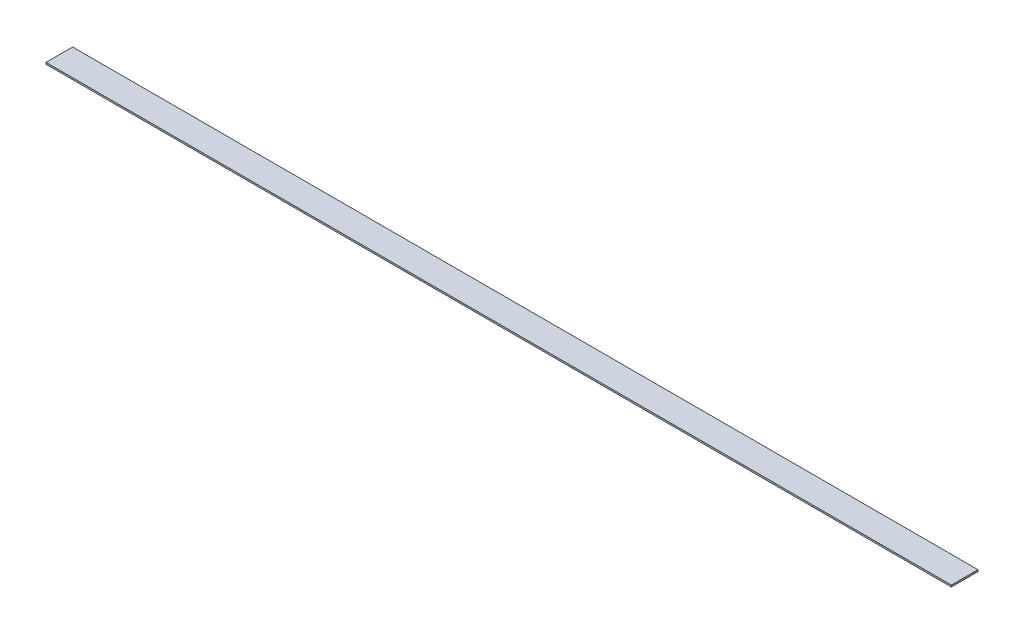
ISO-10303-21;
HEADER;
FILE_DESCRIPTION(('STEP AP214'),'2;1');
FILE_NAME('part.step','',(''),(''),'','','');
FILE_SCHEMA(('AUTOMOTIVE_DESIGN { 1 0 10303 214 1 1 1 1 }'));
ENDSEC;
DATA;
#1=APPLICATION_CONTEXT('core data for automotive mechanical design processes');
#2=APPLICATION_PROTOCOL_DEFINITION('international standard','automotive_design',2000,#1);
#3=PRODUCT_CONTEXT('',#1,'mechanical');
#4=PRODUCT('Part','Part','',(#3));
#5=PRODUCT_RELATED_PRODUCT_CATEGORY('part','',(#4));
#6=PRODUCT_DEFINITION_FORMATION('','',#4);
#7=PRODUCT_DEFINITION_CONTEXT('part definition',#1,'design');
#8=PRODUCT_DEFINITION('design','',#6,#7);
#9=PRODUCT_DEFINITION_SHAPE('','',#8);
#10=(LENGTH_UNIT() NAMED_UNIT(*) SI_UNIT(.MILLI.,.METRE.));
#11=(NAMED_UNIT(*) PLANE_ANGLE_UNIT() SI_UNIT($,.RADIAN.));
#12=(NAMED_UNIT(*) SI_UNIT($,.STERADIAN.) SOLID_ANGLE_UNIT());
#13=UNCERTAINTY_MEASURE_WITH_UNIT(LENGTH_MEASURE(1.E-05),#10,'distance_accuracy_value','');
#14=(GEOMETRIC_REPRESENTATION_CONTEXT(3) GLOBAL_UNCERTAINTY_ASSIGNED_CONTEXT((#13)) GLOBAL_UNIT_ASSIGNED_CONTEXT((#10,
#11,#12)) REPRESENTATION_CONTEXT('',''));
#15=CARTESIAN_POINT('',(0.,0.,0.));
#16=DIRECTION('',(0.,0.,1.));
#17=DIRECTION('',(1.,0.,0.));
#18=AXIS2_PLACEMENT_3D('',#15,#16,#17);
#19=CARTESIAN_POINT('',(0.,1.5875,0.));
#20=DIRECTION('',(1.,0.,0.));
#21=DIRECTION('',(0.,0.,-1.));
#22=AXIS2_PLACEMENT_3D('',#19,#20,#21);
#23=PLANE('',#22);
#24=DIRECTION('',(0.,0.,1.));
#25=VECTOR('',#24,1.);
#26=CARTESIAN_POINT('',(0.,0.,0.));
#27=LINE('',#26,#25);
#28=CARTESIAN_POINT('',(0.,0.,-25.4));
#29=VERTEX_POINT('',#28);
#30=CARTESIAN_POINT('',(0.,0.,0.));
#31=VERTEX_POINT('',#30);
#32=EDGE_CURVE('E96',#29,#31,#27,.T.);
#33=ORIENTED_EDGE('',*,*,#32,.T.);
#34=DIRECTION('',(0.,-1.,0.));
#35=VECTOR('',#34,1.);
#36=CARTESIAN_POINT('',(0.,1.5875,0.));
#37=LINE('',#36,#35);
#38=CARTESIAN_POINT('',(0.,1.5875,0.));
#39=VERTEX_POINT('',#38);
#40=EDGE_CURVE('E11',#39,#31,#37,.T.);
#41=ORIENTED_EDGE('',*,*,#40,.F.);
#42=DIRECTION('',(0.,0.,1.));
#43=VECTOR('',#42,1.);
#44=CARTESIAN_POINT('',(0.,1.5875,0.));
#45=LINE('',#44,#43);
#46=CARTESIAN_POINT('',(0.,1.5875,-25.4));
#47=VERTEX_POINT('',#46);
#48=EDGE_CURVE('E84',#47,#39,#45,.T.);
#49=ORIENTED_EDGE('',*,*,#48,.F.);
#50=DIRECTION('',(0.,-1.,0.));
#51=VECTOR('',#50,1.);
#52=CARTESIAN_POINT('',(0.,1.5875,-25.4));
#53=LINE('',#52,#51);
#54=EDGE_CURVE('E92',#47,#29,#53,.T.);
#55=ORIENTED_EDGE('',*,*,#54,.T.);
#56=EDGE_LOOP('',(#33,#41,#49,#55));
#57=FACE_BOUND('',#56,.T.);
#58=ADVANCED_FACE('F33',(#57),#23,.F.);
#59=CARTESIAN_POINT('',(0.,1.5875,0.));
#60=DIRECTION('',(0.,0.,-1.));
#61=DIRECTION('',(-1.,0.,0.));
#62=AXIS2_PLACEMENT_3D('',#59,#60,#61);
#63=PLANE('',#62);
#64=DIRECTION('',(1.,0.,0.));
#65=VECTOR('',#64,1.);
#66=CARTESIAN_POINT('',(0.,0.,0.));
#67=LINE('',#66,#65);
#68=CARTESIAN_POINT('',(863.6,0.,0.));
#69=VERTEX_POINT('',#68);
#70=EDGE_CURVE('E88',#31,#69,#67,.T.);
#71=ORIENTED_EDGE('',*,*,#70,.T.);
#72=DIRECTION('',(0.,-1.,0.));
#73=VECTOR('',#72,1.);
#74=CARTESIAN_POINT('',(863.6,1.5875,0.));
#75=LINE('',#74,#73);
#76=CARTESIAN_POINT('',(863.6,1.5875,0.));
#77=VERTEX_POINT('',#76);
#78=EDGE_CURVE('E41',#77,#69,#75,.T.);
#79=ORIENTED_EDGE('',*,*,#78,.F.);
#80=DIRECTION('',(1.,0.,0.));
#81=VECTOR('',#80,1.);
#82=CARTESIAN_POINT('',(0.,1.5875,0.));
#83=LINE('',#82,#81);
#84=EDGE_CURVE('E79',#39,#77,#83,.T.);
#85=ORIENTED_EDGE('',*,*,#84,.F.);
#86=ORIENTED_EDGE('',*,*,#40,.T.);
#87=EDGE_LOOP('',(#71,#79,#85,#86));
#88=FACE_BOUND('',#87,.T.);
#89=ADVANCED_FACE('F87',(#88),#63,.F.);
#90=CARTESIAN_POINT('',(863.6,1.5875,0.));
#91=DIRECTION('',(-1.,0.,0.));
#92=DIRECTION('',(0.,0.,1.));
#93=AXIS2_PLACEMENT_3D('',#90,#91,#92);
#94=PLANE('',#93);
#95=DIRECTION('',(0.,0.,-1.));
#96=VECTOR('',#95,1.);
#97=CARTESIAN_POINT('',(863.6,0.,0.));
#98=LINE('',#97,#96);
#99=CARTESIAN_POINT('',(863.6,0.,-25.4));
#100=VERTEX_POINT('',#99);
#101=EDGE_CURVE('E66',#69,#100,#98,.T.);
#102=ORIENTED_EDGE('',*,*,#101,.T.);
#103=DIRECTION('',(0.,-1.,0.));
#104=VECTOR('',#103,1.);
#105=CARTESIAN_POINT('',(863.6,1.5875,-25.4));
#106=LINE('',#105,#104);
#107=CARTESIAN_POINT('',(863.6,1.5875,-25.4));
#108=VERTEX_POINT('',#107);
#109=EDGE_CURVE('E89',#108,#100,#106,.T.);
#110=ORIENTED_EDGE('',*,*,#109,.F.);
#111=DIRECTION('',(0.,0.,-1.));
#112=VECTOR('',#111,1.);
#113=CARTESIAN_POINT('',(863.6,1.5875,0.));
#114=LINE('',#113,#112);
#115=EDGE_CURVE('E82',#77,#108,#114,.T.);
#116=ORIENTED_EDGE('',*,*,#115,.F.);
#117=ORIENTED_EDGE('',*,*,#78,.T.);
#118=EDGE_LOOP('',(#102,#110,#116,#117));
#119=FACE_BOUND('',#118,.T.);
#120=ADVANCED_FACE('F90',(#119),#94,.F.);
#121=CARTESIAN_POINT('',(0.,1.5875,-25.4));
#122=DIRECTION('',(0.,0.,1.));
#123=DIRECTION('',(1.,0.,0.));
#124=AXIS2_PLACEMENT_3D('',#121,#122,#123);
#125=PLANE('',#124);
#126=DIRECTION('',(-1.,0.,0.));
#127=VECTOR('',#126,1.);
#128=CARTESIAN_POINT('',(0.,0.,-25.4));
#129=LINE('',#128,#127);
#130=EDGE_CURVE('E72',#100,#29,#129,.T.);
#131=ORIENTED_EDGE('',*,*,#130,.T.);
#132=ORIENTED_EDGE('',*,*,#54,.F.);
#133=DIRECTION('',(-1.,0.,0.));
#134=VECTOR('',#133,1.);
#135=CARTESIAN_POINT('',(0.,1.5875,-25.4));
#136=LINE('',#135,#134);
#137=EDGE_CURVE('E49',#108,#47,#136,.T.);
#138=ORIENTED_EDGE('',*,*,#137,.F.);
#139=ORIENTED_EDGE('',*,*,#109,.T.);
#140=EDGE_LOOP('',(#131,#132,#138,#139));
#141=FACE_BOUND('',#140,.T.);
#142=ADVANCED_FACE('F103',(#141),#125,.F.);
#143=CARTESIAN_POINT('',(0.,1.5875,0.));
#144=DIRECTION('',(0.,-1.,0.));
#145=DIRECTION('',(0.,0.,-1.));
#146=AXIS2_PLACEMENT_3D('',#143,#144,#145);
#147=PLANE('',#146);
#148=ORIENTED_EDGE('',*,*,#48,.T.);
#149=ORIENTED_EDGE('',*,*,#84,.T.);
#150=ORIENTED_EDGE('',*,*,#115,.T.);
#151=ORIENTED_EDGE('',*,*,#137,.T.);
#152=EDGE_LOOP('',(#148,#149,#150,#151));
#153=FACE_BOUND('',#152,.T.);
#154=ADVANCED_FACE('F80',(#153),#147,.F.);
#155=CARTESIAN_POINT('',(0.,0.,0.));
#156=DIRECTION('',(0.,-1.,0.));
#157=DIRECTION('',(0.,0.,-1.));
#158=AXIS2_PLACEMENT_3D('',#155,#156,#157);
#159=PLANE('',#158);
#160=ORIENTED_EDGE('',*,*,#32,.F.);
#161=ORIENTED_EDGE('',*,*,#130,.F.);
#162=ORIENTED_EDGE('',*,*,#101,.F.);
#163=ORIENTED_EDGE('',*,*,#70,.F.);
#164=EDGE_LOOP('',(#160,#161,#162,#163));
#165=FACE_BOUND('',#164,.T.);
#166=ADVANCED_FACE('F106',(#165),#159,.T.);
#167=CLOSED_SHELL('',(#58,#89,#120,#142,#154,#166));
#168=MANIFOLD_SOLID_BREP('B2',#167);
#169=ADVANCED_BREP_SHAPE_REPRESENTATION('',(#18,#168),#14);
#170=SHAPE_DEFINITION_REPRESENTATION(#9,#169);
ENDSEC;
END-ISO-10303-21;
